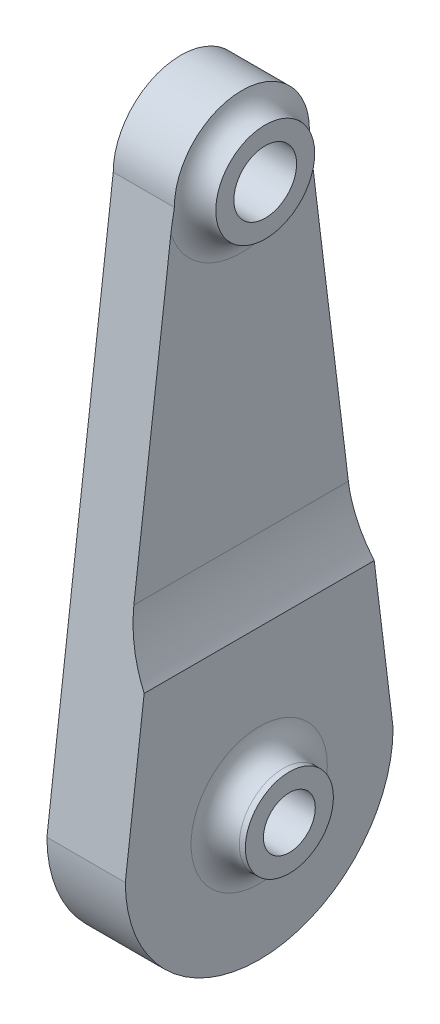
ISO-10303-21;
HEADER;
FILE_DESCRIPTION(('STEP AP214'),'2;1');
FILE_NAME('part.step','',(''),(''),'','','');
FILE_SCHEMA(('AUTOMOTIVE_DESIGN { 1 0 10303 214 1 1 1 1 }'));
ENDSEC;
DATA;
#1=APPLICATION_CONTEXT('core data for automotive mechanical design processes');
#2=APPLICATION_PROTOCOL_DEFINITION('international standard','automotive_design',2000,#1);
#3=PRODUCT_CONTEXT('',#1,'mechanical');
#4=PRODUCT('Part','Part','',(#3));
#5=PRODUCT_RELATED_PRODUCT_CATEGORY('part','',(#4));
#6=PRODUCT_DEFINITION_FORMATION('','',#4);
#7=PRODUCT_DEFINITION_CONTEXT('part definition',#1,'design');
#8=PRODUCT_DEFINITION('design','',#6,#7);
#9=PRODUCT_DEFINITION_SHAPE('','',#8);
#10=(LENGTH_UNIT() NAMED_UNIT(*) SI_UNIT(.MILLI.,.METRE.));
#11=(NAMED_UNIT(*) PLANE_ANGLE_UNIT() SI_UNIT($,.RADIAN.));
#12=(NAMED_UNIT(*) SI_UNIT($,.STERADIAN.) SOLID_ANGLE_UNIT());
#13=UNCERTAINTY_MEASURE_WITH_UNIT(LENGTH_MEASURE(1.E-05),#10,'distance_accuracy_value','');
#14=(GEOMETRIC_REPRESENTATION_CONTEXT(3) GLOBAL_UNCERTAINTY_ASSIGNED_CONTEXT((#13)) GLOBAL_UNIT_ASSIGNED_CONTEXT((#10,
#11,#12)) REPRESENTATION_CONTEXT('',''));
#15=CARTESIAN_POINT('',(0.,0.,0.));
#16=DIRECTION('',(0.,0.,1.));
#17=DIRECTION('',(1.,0.,0.));
#18=AXIS2_PLACEMENT_3D('',#15,#16,#17);
#19=CARTESIAN_POINT('',(4.,0.,0.));
#20=DIRECTION('',(1.,0.,0.));
#21=DIRECTION('',(0.,0.,-1.));
#22=AXIS2_PLACEMENT_3D('',#19,#20,#21);
#23=PLANE('',#22);
#24=CARTESIAN_POINT('',(4.,0.,0.));
#25=DIRECTION('',(1.,0.,0.));
#26=DIRECTION('',(0.,0.,-1.));
#27=AXIS2_PLACEMENT_3D('',#24,#25,#26);
#28=CIRCLE('',#27,5.65);
#29=CARTESIAN_POINT('',(4.,0.,-5.65));
#30=VERTEX_POINT('',#29);
#31=EDGE_CURVE('E200',#30,#30,#28,.F.);
#32=ORIENTED_EDGE('',*,*,#31,.T.);
#33=EDGE_LOOP('',(#32));
#34=FACE_BOUND('',#33,.T.);
#35=DIRECTION('',(0.,-0.992613517897528,0.121319429965253));
#36=VECTOR('',#35,1.);
#37=CARTESIAN_POINT('',(4.,0.,11.1));
#38=LINE('',#37,#36);
#39=CARTESIAN_POINT('',(4.,12.7946727098916,9.53620666879102));
#40=VERTEX_POINT('',#39);
#41=CARTESIAN_POINT('',(4.,0.,11.1));
#42=VERTEX_POINT('',#41);
#43=EDGE_CURVE('E114',#40,#42,#38,.T.);
#44=ORIENTED_EDGE('',*,*,#43,.T.);
#45=CARTESIAN_POINT('',(4.,0.,0.));
#46=DIRECTION('',(1.,0.,0.));
#47=DIRECTION('',(0.,0.,-1.));
#48=AXIS2_PLACEMENT_3D('',#45,#46,#47);
#49=CIRCLE('',#48,11.1);
#50=CARTESIAN_POINT('',(4.,0.,-11.1));
#51=VERTEX_POINT('',#50);
#52=EDGE_CURVE('E124',#42,#51,#49,.T.);
#53=ORIENTED_EDGE('',*,*,#52,.T.);
#54=DIRECTION('',(0.,0.992613517897528,0.121319429965254));
#55=VECTOR('',#54,1.);
#56=CARTESIAN_POINT('',(4.,12.7946727098917,-9.53620666879102));
#57=LINE('',#56,#55);
#58=CARTESIAN_POINT('',(4.,12.7946727098917,-9.53620666879102));
#59=VERTEX_POINT('',#58);
#60=EDGE_CURVE('E130',#51,#59,#57,.T.);
#61=ORIENTED_EDGE('',*,*,#60,.T.);
#62=DIRECTION('',(0.,0.,1.));
#63=VECTOR('',#62,1.);
#64=CARTESIAN_POINT('',(4.,12.7946727098916,9.53620666879102));
#65=LINE('',#64,#63);
#66=EDGE_CURVE('E134',#59,#40,#65,.T.);
#67=ORIENTED_EDGE('',*,*,#66,.T.);
#68=EDGE_LOOP('',(#44,#53,#61,#67));
#69=FACE_BOUND('',#68,.T.);
#70=ADVANCED_FACE('F45',(#34,#69),#23,.T.);
#71=CARTESIAN_POINT('',(2.5,0.,0.));
#72=DIRECTION('',(1.,0.,0.));
#73=DIRECTION('',(0.,0.,-1.));
#74=AXIS2_PLACEMENT_3D('',#71,#72,#73);
#75=PLANE('',#74);
#76=DIRECTION('',(0.,-0.992613517897528,-0.121319429965253));
#77=VECTOR('',#76,1.);
#78=CARTESIAN_POINT('',(2.5,1.33669869845518,-10.9366257146333));
#79=LINE('',#78,#77);
#80=CARTESIAN_POINT('',(2.5,43.1806437999648,-5.82236575778208));
#81=VERTEX_POINT('',#80);
#82=CARTESIAN_POINT('',(2.5,18.062499586318,-8.89236116167224));
#83=VERTEX_POINT('',#82);
#84=EDGE_CURVE('E155',#81,#83,#79,.T.);
#85=ORIENTED_EDGE('',*,*,#84,.F.);
#86=CARTESIAN_POINT('',(2.5,45.,0.));
#87=DIRECTION('',(1.,0.,0.));
#88=DIRECTION('',(0.,0.,-1.));
#89=AXIS2_PLACEMENT_3D('',#86,#87,#88);
#90=CIRCLE('',#89,6.09999999999999);
#91=CARTESIAN_POINT('',(2.5,43.1806437999648,5.82236575778208));
#92=VERTEX_POINT('',#91);
#93=EDGE_CURVE('E204',#81,#92,#90,.F.);
#94=ORIENTED_EDGE('',*,*,#93,.T.);
#95=DIRECTION('',(0.,0.992613517897528,-0.121319429965253));
#96=VECTOR('',#95,1.);
#97=CARTESIAN_POINT('',(2.5,1.33669869845518,10.9366257146333));
#98=LINE('',#97,#96);
#99=CARTESIAN_POINT('',(2.5,18.062499586318,8.89236116167224));
#100=VERTEX_POINT('',#99);
#101=EDGE_CURVE('E158',#100,#92,#98,.T.);
#102=ORIENTED_EDGE('',*,*,#101,.F.);
#103=DIRECTION('',(0.,0.,-1.));
#104=VECTOR('',#103,1.);
#105=CARTESIAN_POINT('',(2.5,18.062499586318,-9.53620666879102));
#106=LINE('',#105,#104);
#107=EDGE_CURVE('E186',#100,#83,#106,.T.);
#108=ORIENTED_EDGE('',*,*,#107,.T.);
#109=EDGE_LOOP('',(#85,#94,#102,#108));
#110=FACE_BOUND('',#109,.T.);
#111=ADVANCED_FACE('F227',(#110),#75,.T.);
#112=CARTESIAN_POINT('',(2.5,1.33669869845518,-10.9366257146333));
#113=DIRECTION('',(0.,0.121319429965253,-0.992613517897528));
#114=DIRECTION('',(0.,0.992613517897528,0.121319429965253));
#115=AXIS2_PLACEMENT_3D('',#112,#113,#114);
#116=PLANE('',#115);
#117=DIRECTION('',(0.,-0.992613517897528,-0.121319429965253));
#118=VECTOR('',#117,1.);
#119=CARTESIAN_POINT('',(-2.5,1.33669869845518,-10.9366257146333));
#120=LINE('',#119,#118);
#121=CARTESIAN_POINT('',(-2.5,45.,-5.6));
#122=VERTEX_POINT('',#121);
#123=CARTESIAN_POINT('',(-2.5,0.,-11.1));
#124=VERTEX_POINT('',#123);
#125=EDGE_CURVE('E170',#122,#124,#120,.T.);
#126=ORIENTED_EDGE('',*,*,#125,.F.);
#127=DIRECTION('',(-1.,0.,0.));
#128=VECTOR('',#127,1.);
#129=CARTESIAN_POINT('',(2.5,45.,-5.6));
#130=LINE('',#129,#128);
#131=CARTESIAN_POINT('',(2.56350832689629,45.,-5.6));
#132=VERTEX_POINT('',#131);
#133=EDGE_CURVE('E66',#132,#122,#130,.T.);
#134=ORIENTED_EDGE('',*,*,#133,.F.);
#135=CARTESIAN_POINT('',(2.56350832689629,45.,-5.6));
#136=CARTESIAN_POINT('',(2.5611215837737,44.9241824353634,-5.60926659123336));
#137=CARTESIAN_POINT('',(2.55839638659535,44.8483763756588,-5.61853177630837));
#138=CARTESIAN_POINT('',(2.55247016182437,44.6967855403426,-5.63705954506924));
#139=CARTESIAN_POINT('',(2.54926915406532,44.6210007639756,-5.64632212884742));
#140=CARTESIAN_POINT('',(2.53925405713822,44.3936754664317,-5.67410633188057));
#141=CARTESIAN_POINT('',(2.53202755682825,44.2421548023334,-5.69262552415926));
#142=CARTESIAN_POINT('',(2.51850432079369,43.939032960805,-5.72967374923495));
#143=CARTESIAN_POINT('',(2.51220775780352,43.7874317736531,-5.74820278322017));
#144=CARTESIAN_POINT('',(2.50297525665358,43.4841235826506,-5.78527378434271));
#145=CARTESIAN_POINT('',(2.50003962576428,43.3324165703934,-5.80381575250748));
#146=CARTESIAN_POINT('',(2.5,43.1806437999648,-5.82236575778208));
#147=B_SPLINE_CURVE_WITH_KNOTS('',3,(#135,#136,#137,#138,#139,#140,#141,#142,#143,#144,#145,
#146),.UNSPECIFIED.,.F.,.F.,(4,2,2,2,2,4),(0.,0.229255220120949,0.458500886706071,
0.916964474748049,1.37551311487167,1.83410367408231),.UNSPECIFIED.);
#148=EDGE_CURVE('E11',#132,#81,#147,.T.);
#149=ORIENTED_EDGE('',*,*,#148,.T.);
#150=ORIENTED_EDGE('',*,*,#84,.T.);
#151=CARTESIAN_POINT('',(12.5,18.062499586318,-8.89236116167224));
#152=DIRECTION('',(0.,0.121319429965253,-0.992613517897528));
#153=DIRECTION('',(0.,0.992613517897528,0.121319429965253));
#154=AXIS2_PLACEMENT_3D('',#151,#152,#153);
#155=ELLIPSE('',#154,10.0744144822661,10.);
#156=EDGE_CURVE('E193',#83,#59,#155,.F.);
#157=ORIENTED_EDGE('',*,*,#156,.T.);
#158=ORIENTED_EDGE('',*,*,#60,.F.);
#159=DIRECTION('',(-1.,0.,0.));
#160=VECTOR('',#159,1.);
#161=CARTESIAN_POINT('',(2.5,0.,-11.1));
#162=LINE('',#161,#160);
#163=EDGE_CURVE('E121',#51,#124,#162,.T.);
#164=ORIENTED_EDGE('',*,*,#163,.T.);
#165=EDGE_LOOP('',(#126,#134,#149,#150,#157,#158,#164));
#166=FACE_BOUND('',#165,.T.);
#167=ADVANCED_FACE('F223',(#166),#116,.T.);
#168=CARTESIAN_POINT('',(2.5,45.,0.));
#169=DIRECTION('',(-1.,0.,0.));
#170=DIRECTION('',(0.,0.,1.));
#171=AXIS2_PLACEMENT_3D('',#168,#169,#170);
#172=CYLINDRICAL_SURFACE('',#171,5.6);
#173=CARTESIAN_POINT('',(-2.5,45.,0.));
#174=DIRECTION('',(1.,0.,0.));
#175=DIRECTION('',(0.,0.,-1.));
#176=AXIS2_PLACEMENT_3D('',#173,#174,#175);
#177=CIRCLE('',#176,5.6);
#178=CARTESIAN_POINT('',(-2.5,45.,5.6));
#179=VERTEX_POINT('',#178);
#180=EDGE_CURVE('E174',#122,#179,#177,.T.);
#181=ORIENTED_EDGE('',*,*,#180,.T.);
#182=DIRECTION('',(-1.,0.,0.));
#183=VECTOR('',#182,1.);
#184=CARTESIAN_POINT('',(2.5,45.,5.6));
#185=LINE('',#184,#183);
#186=CARTESIAN_POINT('',(2.56350832689629,45.,5.6));
#187=VERTEX_POINT('',#186);
#188=EDGE_CURVE('E73',#187,#179,#185,.T.);
#189=ORIENTED_EDGE('',*,*,#188,.F.);
#190=CARTESIAN_POINT('',(2.56350832689629,45.,0.));
#191=DIRECTION('',(1.,0.,0.));
#192=DIRECTION('',(0.,0.,-1.));
#193=AXIS2_PLACEMENT_3D('',#190,#191,#192);
#194=CIRCLE('',#193,5.6);
#195=EDGE_CURVE('E60',#187,#132,#194,.F.);
#196=ORIENTED_EDGE('',*,*,#195,.T.);
#197=ORIENTED_EDGE('',*,*,#133,.T.);
#198=EDGE_LOOP('',(#181,#189,#196,#197));
#199=FACE_BOUND('',#198,.T.);
#200=ADVANCED_FACE('F220',(#199),#172,.T.);
#201=CARTESIAN_POINT('',(2.5,1.33669869845518,10.9366257146333));
#202=DIRECTION('',(0.,0.121319429965253,0.992613517897528));
#203=DIRECTION('',(0.,-0.992613517897528,0.121319429965253));
#204=AXIS2_PLACEMENT_3D('',#201,#202,#203);
#205=PLANE('',#204);
#206=DIRECTION('',(0.,0.992613517897528,-0.121319429965253));
#207=VECTOR('',#206,1.);
#208=CARTESIAN_POINT('',(-2.5,1.33669869845518,10.9366257146333));
#209=LINE('',#208,#207);
#210=CARTESIAN_POINT('',(-2.5,0.,11.1));
#211=VERTEX_POINT('',#210);
#212=EDGE_CURVE('E116',#211,#179,#209,.T.);
#213=ORIENTED_EDGE('',*,*,#212,.F.);
#214=DIRECTION('',(-1.,0.,0.));
#215=VECTOR('',#214,1.);
#216=CARTESIAN_POINT('',(2.5,0.,11.1));
#217=LINE('',#216,#215);
#218=EDGE_CURVE('E110',#42,#211,#217,.T.);
#219=ORIENTED_EDGE('',*,*,#218,.F.);
#220=ORIENTED_EDGE('',*,*,#43,.F.);
#221=CARTESIAN_POINT('',(12.5,18.062499586318,8.89236116167224));
#222=DIRECTION('',(0.,0.121319429965253,0.992613517897528));
#223=DIRECTION('',(0.,-0.992613517897528,0.121319429965253));
#224=AXIS2_PLACEMENT_3D('',#221,#222,#223);
#225=ELLIPSE('',#224,10.0744144822661,10.);
#226=EDGE_CURVE('E190',#40,#100,#225,.F.);
#227=ORIENTED_EDGE('',*,*,#226,.T.);
#228=ORIENTED_EDGE('',*,*,#101,.T.);
#229=CARTESIAN_POINT('',(2.5,43.1806437999648,5.82236575778208));
#230=CARTESIAN_POINT('',(2.50003956625991,43.3323688140954,5.80382158938834));
#231=CARTESIAN_POINT('',(2.50297337979755,43.484028136701,5.78528544995876));
#232=CARTESIAN_POINT('',(2.51220090380789,43.7872410078057,5.74822609904597));
#233=CARTESIAN_POINT('',(2.51849430715028,43.9387945647057,5.72970288653597));
#234=CARTESIAN_POINT('',(2.53201630677088,44.2419164557671,5.69265465540624));
#235=CARTESIAN_POINT('',(2.53924531668056,44.3934847666585,5.67412963963063));
#236=CARTESIAN_POINT('',(2.54926407246373,44.6208815490514,5.64633669956038));
#237=CARTESIAN_POINT('',(2.55246628240395,44.6966901600809,5.63707120265678));
#238=CARTESIAN_POINT('',(2.55839467481677,44.8483286756985,5.61853760630352));
#239=CARTESIAN_POINT('',(2.56112083744488,44.9241585810425,5.60926950676147));
#240=CARTESIAN_POINT('',(2.56350832689629,45.,5.6));
#241=B_SPLINE_CURVE_WITH_KNOTS('',3,(#229,#230,#231,#232,#233,#234,#235,#236,#237,#238,#239,
#240),.UNSPECIFIED.,.F.,.F.,(4,2,2,2,2,4),(0.,0.458446333297943,0.916850763070221,
1.37545855006924,1.60477633994256,1.83410368686992),.UNSPECIFIED.);
#242=EDGE_CURVE('E208',#92,#187,#241,.T.);
#243=ORIENTED_EDGE('',*,*,#242,.T.);
#244=ORIENTED_EDGE('',*,*,#188,.T.);
#245=EDGE_LOOP('',(#213,#219,#220,#227,#228,#243,#244));
#246=FACE_BOUND('',#245,.T.);
#247=ADVANCED_FACE('F112',(#246),#205,.T.);
#248=CARTESIAN_POINT('',(2.5,45.,0.));
#249=DIRECTION('',(-1.,0.,0.));
#250=DIRECTION('',(0.,0.,1.));
#251=AXIS2_PLACEMENT_3D('',#248,#249,#250);
#252=CYLINDRICAL_SURFACE('',#251,2.6);
#253=CARTESIAN_POINT('',(-2.5,45.,0.));
#254=DIRECTION('',(1.,0.,0.));
#255=DIRECTION('',(0.,0.,-1.));
#256=AXIS2_PLACEMENT_3D('',#253,#254,#255);
#257=CIRCLE('',#256,2.6);
#258=CARTESIAN_POINT('',(-2.5,45.,-2.6));
#259=VERTEX_POINT('',#258);
#260=EDGE_CURVE('E166',#259,#259,#257,.T.);
#261=ORIENTED_EDGE('',*,*,#260,.F.);
#262=EDGE_LOOP('',(#261));
#263=FACE_BOUND('',#262,.T.);
#264=CARTESIAN_POINT('',(4.5,45.,0.));
#265=DIRECTION('',(1.,0.,0.));
#266=DIRECTION('',(0.,0.,-1.));
#267=AXIS2_PLACEMENT_3D('',#264,#265,#266);
#268=CIRCLE('',#267,2.6);
#269=CARTESIAN_POINT('',(4.5,45.,-2.6));
#270=VERTEX_POINT('',#269);
#271=EDGE_CURVE('E288',#270,#270,#268,.T.);
#272=ORIENTED_EDGE('',*,*,#271,.T.);
#273=EDGE_LOOP('',(#272));
#274=FACE_BOUND('',#273,.T.);
#275=ADVANCED_FACE('F219',(#263,#274),#252,.F.);
#276=CARTESIAN_POINT('',(2.5,0.,0.));
#277=DIRECTION('',(-1.,0.,0.));
#278=DIRECTION('',(0.,0.,1.));
#279=AXIS2_PLACEMENT_3D('',#276,#277,#278);
#280=CYLINDRICAL_SURFACE('',#279,8.1);
#281=CARTESIAN_POINT('',(2.5,0.,0.));
#282=DIRECTION('',(1.,0.,0.));
#283=DIRECTION('',(0.,0.,-1.));
#284=AXIS2_PLACEMENT_3D('',#281,#282,#283);
#285=CIRCLE('',#284,8.1);
#286=CARTESIAN_POINT('',(2.5,0.,-8.1));
#287=VERTEX_POINT('',#286);
#288=EDGE_CURVE('E150',#287,#287,#285,.T.);
#289=ORIENTED_EDGE('',*,*,#288,.T.);
#290=EDGE_LOOP('',(#289));
#291=FACE_BOUND('',#290,.T.);
#292=CARTESIAN_POINT('',(-2.5,0.,0.));
#293=DIRECTION('',(1.,0.,0.));
#294=DIRECTION('',(0.,0.,-1.));
#295=AXIS2_PLACEMENT_3D('',#292,#293,#294);
#296=CIRCLE('',#295,8.1);
#297=CARTESIAN_POINT('',(-2.5,0.,-8.1));
#298=VERTEX_POINT('',#297);
#299=EDGE_CURVE('E154',#298,#298,#296,.T.);
#300=ORIENTED_EDGE('',*,*,#299,.F.);
#301=EDGE_LOOP('',(#300));
#302=FACE_BOUND('',#301,.T.);
#303=ADVANCED_FACE('F230',(#291,#302),#280,.F.);
#304=CARTESIAN_POINT('',(2.5,0.,0.));
#305=DIRECTION('',(-1.,0.,0.));
#306=DIRECTION('',(0.,0.,1.));
#307=AXIS2_PLACEMENT_3D('',#304,#305,#306);
#308=CYLINDRICAL_SURFACE('',#307,11.1);
#309=CARTESIAN_POINT('',(-2.5,0.,0.));
#310=DIRECTION('',(1.,0.,0.));
#311=DIRECTION('',(0.,0.,-1.));
#312=AXIS2_PLACEMENT_3D('',#309,#310,#311);
#313=CIRCLE('',#312,11.1);
#314=EDGE_CURVE('E159',#211,#124,#313,.T.);
#315=ORIENTED_EDGE('',*,*,#314,.T.);
#316=ORIENTED_EDGE('',*,*,#163,.F.);
#317=ORIENTED_EDGE('',*,*,#52,.F.);
#318=ORIENTED_EDGE('',*,*,#218,.T.);
#319=EDGE_LOOP('',(#315,#316,#317,#318));
#320=FACE_BOUND('',#319,.T.);
#321=ADVANCED_FACE('F125',(#320),#308,.T.);
#322=CARTESIAN_POINT('',(-2.5,0.,0.));
#323=DIRECTION('',(1.,0.,0.));
#324=DIRECTION('',(0.,0.,-1.));
#325=AXIS2_PLACEMENT_3D('',#322,#323,#324);
#326=PLANE('',#325);
#327=ORIENTED_EDGE('',*,*,#299,.T.);
#328=EDGE_LOOP('',(#327));
#329=FACE_BOUND('',#328,.T.);
#330=ORIENTED_EDGE('',*,*,#260,.T.);
#331=EDGE_LOOP('',(#330));
#332=FACE_BOUND('',#331,.T.);
#333=ORIENTED_EDGE('',*,*,#125,.T.);
#334=ORIENTED_EDGE('',*,*,#314,.F.);
#335=ORIENTED_EDGE('',*,*,#212,.T.);
#336=ORIENTED_EDGE('',*,*,#180,.F.);
#337=EDGE_LOOP('',(#333,#334,#335,#336));
#338=FACE_BOUND('',#337,.T.);
#339=ADVANCED_FACE('F265',(#329,#332,#338),#326,.F.);
#340=CARTESIAN_POINT('',(2.5,0.,0.));
#341=DIRECTION('',(1.,0.,0.));
#342=DIRECTION('',(0.,0.,-1.));
#343=AXIS2_PLACEMENT_3D('',#340,#341,#342);
#344=PLANE('',#343);
#345=ORIENTED_EDGE('',*,*,#288,.F.);
#346=EDGE_LOOP('',(#345));
#347=FACE_BOUND('',#346,.T.);
#348=CARTESIAN_POINT('',(2.5,0.,0.));
#349=DIRECTION('',(1.,0.,0.));
#350=DIRECTION('',(0.,0.,-1.));
#351=AXIS2_PLACEMENT_3D('',#348,#349,#350);
#352=CIRCLE('',#351,2.15);
#353=CARTESIAN_POINT('',(2.5,0.,-2.15));
#354=VERTEX_POINT('',#353);
#355=EDGE_CURVE('E136',#354,#354,#352,.T.);
#356=ORIENTED_EDGE('',*,*,#355,.T.);
#357=EDGE_LOOP('',(#356));
#358=FACE_BOUND('',#357,.T.);
#359=ADVANCED_FACE('F263',(#347,#358),#344,.F.);
#360=CARTESIAN_POINT('',(4.,0.,0.));
#361=DIRECTION('',(-1.,0.,0.));
#362=DIRECTION('',(0.,0.,1.));
#363=AXIS2_PLACEMENT_3D('',#360,#361,#362);
#364=CYLINDRICAL_SURFACE('',#363,2.15);
#365=ORIENTED_EDGE('',*,*,#355,.F.);
#366=EDGE_LOOP('',(#365));
#367=FACE_BOUND('',#366,.T.);
#368=CARTESIAN_POINT('',(6.5,0.,0.));
#369=DIRECTION('',(1.,0.,0.));
#370=DIRECTION('',(0.,0.,-1.));
#371=AXIS2_PLACEMENT_3D('',#368,#369,#370);
#372=CIRCLE('',#371,2.15);
#373=CARTESIAN_POINT('',(6.5,0.,-2.15));
#374=VERTEX_POINT('',#373);
#375=EDGE_CURVE('E297',#374,#374,#372,.T.);
#376=ORIENTED_EDGE('',*,*,#375,.T.);
#377=EDGE_LOOP('',(#376));
#378=FACE_BOUND('',#377,.T.);
#379=ADVANCED_FACE('F238',(#367,#378),#364,.F.);
#380=CARTESIAN_POINT('',(12.5,18.062499586318,9.53620666879102));
#381=DIRECTION('',(0.,0.,1.));
#382=DIRECTION('',(0.,-1.,0.));
#383=AXIS2_PLACEMENT_3D('',#380,#381,#382);
#384=CYLINDRICAL_SURFACE('',#383,10.);
#385=ORIENTED_EDGE('',*,*,#156,.F.);
#386=ORIENTED_EDGE('',*,*,#107,.F.);
#387=ORIENTED_EDGE('',*,*,#226,.F.);
#388=ORIENTED_EDGE('',*,*,#66,.F.);
#389=EDGE_LOOP('',(#385,#386,#387,#388));
#390=FACE_BOUND('',#389,.T.);
#391=ADVANCED_FACE('F235',(#390),#384,.F.);
#392=CARTESIAN_POINT('',(4.5,45.,0.));
#393=DIRECTION('',(1.,0.,0.));
#394=DIRECTION('',(0.,0.,-1.));
#395=AXIS2_PLACEMENT_3D('',#392,#393,#394);
#396=PLANE('',#395);
#397=CARTESIAN_POINT('',(4.5,45.,0.));
#398=DIRECTION('',(1.,0.,0.));
#399=DIRECTION('',(0.,0.,-1.));
#400=AXIS2_PLACEMENT_3D('',#397,#398,#399);
#401=CIRCLE('',#400,4.09999999999999);
#402=CARTESIAN_POINT('',(4.5,45.,-4.09999999999999));
#403=VERTEX_POINT('',#402);
#404=EDGE_CURVE('E142',#403,#403,#401,.T.);
#405=ORIENTED_EDGE('',*,*,#404,.T.);
#406=EDGE_LOOP('',(#405));
#407=FACE_BOUND('',#406,.T.);
#408=ORIENTED_EDGE('',*,*,#271,.F.);
#409=EDGE_LOOP('',(#408));
#410=FACE_BOUND('',#409,.T.);
#411=ADVANCED_FACE('F237',(#407,#410),#396,.T.);
#412=CARTESIAN_POINT('',(6.5,0.,0.));
#413=DIRECTION('',(1.,0.,0.));
#414=DIRECTION('',(0.,0.,-1.));
#415=AXIS2_PLACEMENT_3D('',#412,#413,#414);
#416=PLANE('',#415);
#417=CARTESIAN_POINT('',(6.5,0.,0.));
#418=DIRECTION('',(1.,0.,0.));
#419=DIRECTION('',(0.,0.,-1.));
#420=AXIS2_PLACEMENT_3D('',#417,#418,#419);
#421=CIRCLE('',#420,3.65);
#422=CARTESIAN_POINT('',(6.5,0.,-3.65));
#423=VERTEX_POINT('',#422);
#424=EDGE_CURVE('E291',#423,#423,#421,.T.);
#425=ORIENTED_EDGE('',*,*,#424,.T.);
#426=EDGE_LOOP('',(#425));
#427=FACE_BOUND('',#426,.T.);
#428=ORIENTED_EDGE('',*,*,#375,.F.);
#429=EDGE_LOOP('',(#428));
#430=FACE_BOUND('',#429,.T.);
#431=ADVANCED_FACE('F248',(#427,#430),#416,.T.);
#432=CARTESIAN_POINT('',(6.5,0.,0.));
#433=DIRECTION('',(-1.,0.,0.));
#434=DIRECTION('',(0.,0.,1.));
#435=AXIS2_PLACEMENT_3D('',#432,#433,#434);
#436=CYLINDRICAL_SURFACE('',#435,3.65);
#437=CARTESIAN_POINT('',(6.,0.,0.));
#438=DIRECTION('',(1.,0.,0.));
#439=DIRECTION('',(0.,0.,-1.));
#440=AXIS2_PLACEMENT_3D('',#437,#438,#439);
#441=CIRCLE('',#440,3.65);
#442=CARTESIAN_POINT('',(6.,0.,-3.65));
#443=VERTEX_POINT('',#442);
#444=EDGE_CURVE('E196',#443,#443,#441,.T.);
#445=ORIENTED_EDGE('',*,*,#444,.T.);
#446=EDGE_LOOP('',(#445));
#447=FACE_BOUND('',#446,.T.);
#448=ORIENTED_EDGE('',*,*,#424,.F.);
#449=EDGE_LOOP('',(#448));
#450=FACE_BOUND('',#449,.T.);
#451=ADVANCED_FACE('F242',(#447,#450),#436,.T.);
#452=CARTESIAN_POINT('',(6.,0.,0.));
#453=DIRECTION('',(1.,0.,0.));
#454=DIRECTION('',(0.,0.,-1.));
#455=AXIS2_PLACEMENT_3D('',#452,#453,#454);
#456=TOROIDAL_SURFACE('',#455,5.65,2.);
#457=ORIENTED_EDGE('',*,*,#31,.F.);
#458=EDGE_LOOP('',(#457));
#459=FACE_BOUND('',#458,.T.);
#460=ORIENTED_EDGE('',*,*,#444,.F.);
#461=EDGE_LOOP('',(#460));
#462=FACE_BOUND('',#461,.T.);
#463=ADVANCED_FACE('F240',(#459,#462),#456,.F.);
#464=CARTESIAN_POINT('',(4.5,45.,0.));
#465=DIRECTION('',(1.,0.,0.));
#466=DIRECTION('',(0.,0.,-1.));
#467=AXIS2_PLACEMENT_3D('',#464,#465,#466);
#468=TOROIDAL_SURFACE('',#467,6.09999999999999,2.);
#469=ORIENTED_EDGE('',*,*,#242,.F.);
#470=ORIENTED_EDGE('',*,*,#93,.F.);
#471=ORIENTED_EDGE('',*,*,#148,.F.);
#472=ORIENTED_EDGE('',*,*,#195,.F.);
#473=EDGE_LOOP('',(#469,#470,#471,#472));
#474=FACE_BOUND('',#473,.T.);
#475=ORIENTED_EDGE('',*,*,#404,.F.);
#476=EDGE_LOOP('',(#475));
#477=FACE_BOUND('',#476,.T.);
#478=ADVANCED_FACE('F47',(#474,#477),#468,.F.);
#479=CLOSED_SHELL('',(#70,#111,#167,#200,#247,#275,#303,#321,#339,#359,#379,#391,#411,#431,#451,
#463,#478));
#480=MANIFOLD_SOLID_BREP('B2',#479);
#481=ADVANCED_BREP_SHAPE_REPRESENTATION('',(#18,#480),#14);
#482=SHAPE_DEFINITION_REPRESENTATION(#9,#481);
ENDSEC;
END-ISO-10303-21;
